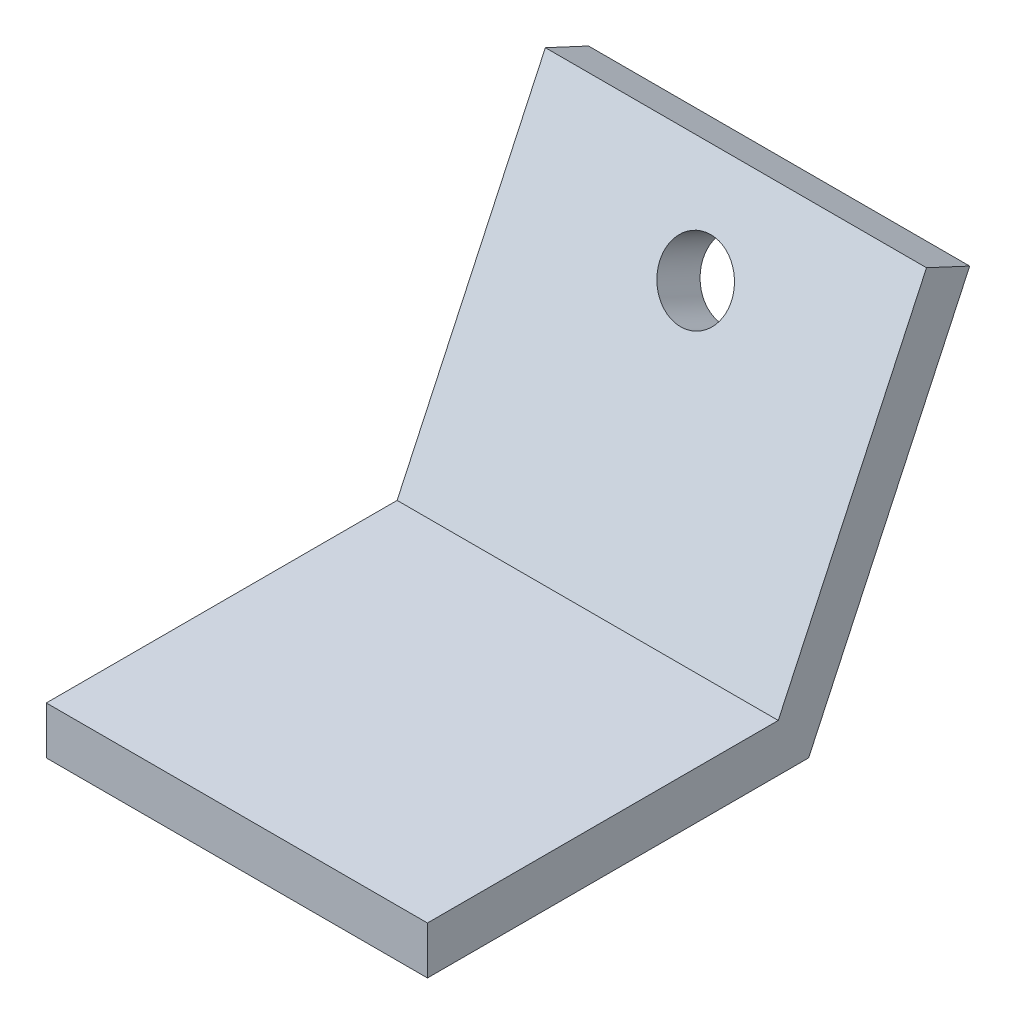
ISO-10303-21;
HEADER;
FILE_DESCRIPTION(('STEP AP214'),'2;1');
FILE_NAME('part.step','',(''),(''),'','','');
FILE_SCHEMA(('AUTOMOTIVE_DESIGN { 1 0 10303 214 1 1 1 1 }'));
ENDSEC;
DATA;
#1=APPLICATION_CONTEXT('core data for automotive mechanical design processes');
#2=APPLICATION_PROTOCOL_DEFINITION('international standard','automotive_design',2000,#1);
#3=PRODUCT_CONTEXT('',#1,'mechanical');
#4=PRODUCT('Part','Part','',(#3));
#5=PRODUCT_RELATED_PRODUCT_CATEGORY('part','',(#4));
#6=PRODUCT_DEFINITION_FORMATION('','',#4);
#7=PRODUCT_DEFINITION_CONTEXT('part definition',#1,'design');
#8=PRODUCT_DEFINITION('design','',#6,#7);
#9=PRODUCT_DEFINITION_SHAPE('','',#8);
#10=(LENGTH_UNIT() NAMED_UNIT(*) SI_UNIT(.MILLI.,.METRE.));
#11=(NAMED_UNIT(*) PLANE_ANGLE_UNIT() SI_UNIT($,.RADIAN.));
#12=(NAMED_UNIT(*) SI_UNIT($,.STERADIAN.) SOLID_ANGLE_UNIT());
#13=UNCERTAINTY_MEASURE_WITH_UNIT(LENGTH_MEASURE(1.E-05),#10,'distance_accuracy_value','');
#14=(GEOMETRIC_REPRESENTATION_CONTEXT(3) GLOBAL_UNCERTAINTY_ASSIGNED_CONTEXT((#13)) GLOBAL_UNIT_ASSIGNED_CONTEXT((#10,
#11,#12)) REPRESENTATION_CONTEXT('',''));
#15=CARTESIAN_POINT('',(0.,0.,0.));
#16=DIRECTION('',(0.,0.,1.));
#17=DIRECTION('',(1.,0.,0.));
#18=AXIS2_PLACEMENT_3D('',#15,#16,#17);
#19=CARTESIAN_POINT('',(50.8,6.35,-21.3546038438724));
#20=DIRECTION('',(0.,-1.,0.));
#21=DIRECTION('',(0.,0.,-1.));
#22=AXIS2_PLACEMENT_3D('',#19,#20,#21);
#23=PLANE('',#22);
#24=DIRECTION('',(0.,0.,1.));
#25=VECTOR('',#24,1.);
#26=CARTESIAN_POINT('',(0.,6.35,-21.3546038438724));
#27=LINE('',#26,#25);
#28=CARTESIAN_POINT('',(0.,6.35,-21.3546038438724));
#29=VERTEX_POINT('',#28);
#30=CARTESIAN_POINT('',(0.,6.35,25.4));
#31=VERTEX_POINT('',#30);
#32=EDGE_CURVE('E118',#29,#31,#27,.T.);
#33=ORIENTED_EDGE('',*,*,#32,.T.);
#34=DIRECTION('',(-1.,0.,0.));
#35=VECTOR('',#34,1.);
#36=CARTESIAN_POINT('',(50.8,6.35,25.4));
#37=LINE('',#36,#35);
#38=CARTESIAN_POINT('',(50.8,6.35,25.4));
#39=VERTEX_POINT('',#38);
#40=EDGE_CURVE('E41',#39,#31,#37,.T.);
#41=ORIENTED_EDGE('',*,*,#40,.F.);
#42=DIRECTION('',(0.,0.,1.));
#43=VECTOR('',#42,1.);
#44=CARTESIAN_POINT('',(50.8,6.35,-21.3546038438724));
#45=LINE('',#44,#43);
#46=CARTESIAN_POINT('',(50.8,6.35,-21.3546038438724));
#47=VERTEX_POINT('',#46);
#48=EDGE_CURVE('E129',#47,#39,#45,.T.);
#49=ORIENTED_EDGE('',*,*,#48,.F.);
#50=DIRECTION('',(-1.,0.,0.));
#51=VECTOR('',#50,1.);
#52=CARTESIAN_POINT('',(50.8,6.35,-21.3546038438724));
#53=LINE('',#52,#51);
#54=EDGE_CURVE('E114',#47,#29,#53,.T.);
#55=ORIENTED_EDGE('',*,*,#54,.T.);
#56=EDGE_LOOP('',(#33,#41,#49,#55));
#57=FACE_BOUND('',#56,.T.);
#58=ADVANCED_FACE('F33',(#57),#23,.F.);
#59=CARTESIAN_POINT('',(50.8,6.35,25.4));
#60=DIRECTION('',(0.,0.,-1.));
#61=DIRECTION('',(-1.,0.,0.));
#62=AXIS2_PLACEMENT_3D('',#59,#60,#61);
#63=PLANE('',#62);
#64=DIRECTION('',(0.,-1.,0.));
#65=VECTOR('',#64,1.);
#66=CARTESIAN_POINT('',(0.,6.35,25.4));
#67=LINE('',#66,#65);
#68=CARTESIAN_POINT('',(0.,0.,25.4));
#69=VERTEX_POINT('',#68);
#70=EDGE_CURVE('E121',#31,#69,#67,.T.);
#71=ORIENTED_EDGE('',*,*,#70,.T.);
#72=DIRECTION('',(-1.,0.,0.));
#73=VECTOR('',#72,1.);
#74=CARTESIAN_POINT('',(50.8,0.,25.4));
#75=LINE('',#74,#73);
#76=CARTESIAN_POINT('',(50.8,0.,25.4));
#77=VERTEX_POINT('',#76);
#78=EDGE_CURVE('E133',#77,#69,#75,.T.);
#79=ORIENTED_EDGE('',*,*,#78,.F.);
#80=DIRECTION('',(0.,-1.,0.));
#81=VECTOR('',#80,1.);
#82=CARTESIAN_POINT('',(50.8,6.35,25.4));
#83=LINE('',#82,#81);
#84=EDGE_CURVE('E87',#39,#77,#83,.T.);
#85=ORIENTED_EDGE('',*,*,#84,.F.);
#86=ORIENTED_EDGE('',*,*,#40,.T.);
#87=EDGE_LOOP('',(#71,#79,#85,#86));
#88=FACE_BOUND('',#87,.T.);
#89=ADVANCED_FACE('F136',(#88),#63,.F.);
#90=CARTESIAN_POINT('',(50.8,0.,25.4));
#91=DIRECTION('',(0.,1.,0.));
#92=DIRECTION('',(0.,0.,1.));
#93=AXIS2_PLACEMENT_3D('',#90,#91,#92);
#94=PLANE('',#93);
#95=CARTESIAN_POINT('',(25.4,0.,0.));
#96=DIRECTION('',(0.,1.,0.));
#97=DIRECTION('',(0.,0.,1.));
#98=AXIS2_PLACEMENT_3D('',#95,#96,#97);
#99=CIRCLE('',#98,4.7625);
#100=CARTESIAN_POINT('',(25.4,0.,4.7625));
#101=VERTEX_POINT('',#100);
#102=EDGE_CURVE('E11',#101,#101,#99,.F.);
#103=ORIENTED_EDGE('',*,*,#102,.F.);
#104=EDGE_LOOP('',(#103));
#105=FACE_BOUND('',#104,.T.);
#106=DIRECTION('',(0.,0.,-1.));
#107=VECTOR('',#106,1.);
#108=CARTESIAN_POINT('',(0.,0.,25.4));
#109=LINE('',#108,#107);
#110=CARTESIAN_POINT('',(0.,0.,-25.4));
#111=VERTEX_POINT('',#110);
#112=EDGE_CURVE('E124',#69,#111,#109,.T.);
#113=ORIENTED_EDGE('',*,*,#112,.T.);
#114=DIRECTION('',(-1.,0.,0.));
#115=VECTOR('',#114,1.);
#116=CARTESIAN_POINT('',(50.8,0.,-25.4));
#117=LINE('',#116,#115);
#118=CARTESIAN_POINT('',(50.8,0.,-25.4));
#119=VERTEX_POINT('',#118);
#120=EDGE_CURVE('E109',#119,#111,#117,.T.);
#121=ORIENTED_EDGE('',*,*,#120,.F.);
#122=DIRECTION('',(0.,0.,-1.));
#123=VECTOR('',#122,1.);
#124=CARTESIAN_POINT('',(50.8,0.,25.4));
#125=LINE('',#124,#123);
#126=EDGE_CURVE('E100',#77,#119,#125,.T.);
#127=ORIENTED_EDGE('',*,*,#126,.F.);
#128=ORIENTED_EDGE('',*,*,#78,.T.);
#129=EDGE_LOOP('',(#113,#121,#127,#128));
#130=FACE_BOUND('',#129,.T.);
#131=ADVANCED_FACE('F144',(#105,#130),#94,.F.);
#132=CARTESIAN_POINT('',(50.8,0.,-25.4));
#133=DIRECTION('',(0.,0.422618261740697,0.906307787036651));
#134=DIRECTION('',(0.,-0.906307787036651,0.422618261740697));
#135=AXIS2_PLACEMENT_3D('',#132,#133,#134);
#136=PLANE('',#135);
#137=CARTESIAN_POINT('',(25.4,34.5303266860964,-41.5017557723206));
#138=DIRECTION('',(0.,-0.422618261740697,-0.906307787036651));
#139=DIRECTION('',(0.,0.906307787036651,-0.422618261740697));
#140=AXIS2_PLACEMENT_3D('',#137,#138,#139);
#141=CIRCLE('',#140,4.7625);
#142=CARTESIAN_POINT('',(25.4,38.8466175218585,-43.5144752438606));
#143=VERTEX_POINT('',#142);
#144=EDGE_CURVE('E150',#143,#143,#141,.T.);
#145=ORIENTED_EDGE('',*,*,#144,.F.);
#146=EDGE_LOOP('',(#145));
#147=FACE_BOUND('',#146,.T.);
#148=DIRECTION('',(0.,0.906307787036651,-0.422618261740697));
#149=VECTOR('',#148,1.);
#150=CARTESIAN_POINT('',(0.,0.,-25.4));
#151=LINE('',#150,#149);
#152=CARTESIAN_POINT('',(0.,46.0404355814619,-46.8690076964274));
#153=VERTEX_POINT('',#152);
#154=EDGE_CURVE('E108',#111,#153,#151,.T.);
#155=ORIENTED_EDGE('',*,*,#154,.T.);
#156=DIRECTION('',(-1.,0.,0.));
#157=VECTOR('',#156,1.);
#158=CARTESIAN_POINT('',(50.8,46.0404355814619,-46.8690076964274));
#159=LINE('',#158,#157);
#160=CARTESIAN_POINT('',(50.8,46.0404355814619,-46.8690076964274));
#161=VERTEX_POINT('',#160);
#162=EDGE_CURVE('E105',#161,#153,#159,.T.);
#163=ORIENTED_EDGE('',*,*,#162,.F.);
#164=DIRECTION('',(0.,0.906307787036651,-0.422618261740697));
#165=VECTOR('',#164,1.);
#166=CARTESIAN_POINT('',(50.8,0.,-25.4));
#167=LINE('',#166,#165);
#168=EDGE_CURVE('E94',#119,#161,#167,.T.);
#169=ORIENTED_EDGE('',*,*,#168,.F.);
#170=ORIENTED_EDGE('',*,*,#120,.T.);
#171=EDGE_LOOP('',(#155,#163,#169,#170));
#172=FACE_BOUND('',#171,.T.);
#173=ADVANCED_FACE('F106',(#147,#172),#136,.F.);
#174=CARTESIAN_POINT('',(50.8,46.0404355814619,-46.8690076964274));
#175=DIRECTION('',(0.,-0.906307787036651,0.422618261740697));
#176=DIRECTION('',(0.,-0.422618261740697,-0.906307787036651));
#177=AXIS2_PLACEMENT_3D('',#174,#175,#176);
#178=PLANE('',#177);
#179=DIRECTION('',(0.,0.422618261740697,0.906307787036651));
#180=VECTOR('',#179,1.);
#181=CARTESIAN_POINT('',(0.,46.0404355814619,-46.8690076964274));
#182=LINE('',#181,#180);
#183=CARTESIAN_POINT('',(0.,48.7240615435153,-41.1139532487447));
#184=VERTEX_POINT('',#183);
#185=EDGE_CURVE('E72',#153,#184,#182,.T.);
#186=ORIENTED_EDGE('',*,*,#185,.T.);
#187=DIRECTION('',(-1.,0.,0.));
#188=VECTOR('',#187,1.);
#189=CARTESIAN_POINT('',(50.8,48.7240615435153,-41.1139532487447));
#190=LINE('',#189,#188);
#191=CARTESIAN_POINT('',(50.8,48.7240615435153,-41.1139532487447));
#192=VERTEX_POINT('',#191);
#193=EDGE_CURVE('E110',#192,#184,#190,.T.);
#194=ORIENTED_EDGE('',*,*,#193,.F.);
#195=DIRECTION('',(0.,0.422618261740697,0.906307787036651));
#196=VECTOR('',#195,1.);
#197=CARTESIAN_POINT('',(50.8,46.0404355814619,-46.8690076964274));
#198=LINE('',#197,#196);
#199=EDGE_CURVE('E98',#161,#192,#198,.T.);
#200=ORIENTED_EDGE('',*,*,#199,.F.);
#201=ORIENTED_EDGE('',*,*,#162,.T.);
#202=EDGE_LOOP('',(#186,#194,#200,#201));
#203=FACE_BOUND('',#202,.T.);
#204=ADVANCED_FACE('F112',(#203),#178,.F.);
#205=CARTESIAN_POINT('',(50.8,48.7240615435153,-41.1139532487447));
#206=DIRECTION('',(0.,-0.422618261740697,-0.906307787036651));
#207=DIRECTION('',(0.,0.906307787036651,-0.422618261740697));
#208=AXIS2_PLACEMENT_3D('',#205,#206,#207);
#209=PLANE('',#208);
#210=CARTESIAN_POINT('',(25.4,37.2139526481498,-35.7467013246378));
#211=DIRECTION('',(0.,-0.422618261740697,-0.906307787036651));
#212=DIRECTION('',(0.,0.906307787036651,-0.422618261740697));
#213=AXIS2_PLACEMENT_3D('',#210,#211,#212);
#214=CIRCLE('',#213,4.7625);
#215=CARTESIAN_POINT('',(25.4,41.5302434839119,-37.7594207961779));
#216=VERTEX_POINT('',#215);
#217=EDGE_CURVE('E122',#216,#216,#214,.F.);
#218=ORIENTED_EDGE('',*,*,#217,.F.);
#219=EDGE_LOOP('',(#218));
#220=FACE_BOUND('',#219,.T.);
#221=DIRECTION('',(0.,-0.906307787036651,0.422618261740697));
#222=VECTOR('',#221,1.);
#223=CARTESIAN_POINT('',(0.,48.7240615435153,-41.1139532487447));
#224=LINE('',#223,#222);
#225=EDGE_CURVE('E78',#184,#29,#224,.T.);
#226=ORIENTED_EDGE('',*,*,#225,.T.);
#227=ORIENTED_EDGE('',*,*,#54,.F.);
#228=DIRECTION('',(0.,-0.906307787036651,0.422618261740697));
#229=VECTOR('',#228,1.);
#230=CARTESIAN_POINT('',(50.8,48.7240615435153,-41.1139532487447));
#231=LINE('',#230,#229);
#232=EDGE_CURVE('E49',#192,#47,#231,.T.);
#233=ORIENTED_EDGE('',*,*,#232,.F.);
#234=ORIENTED_EDGE('',*,*,#193,.T.);
#235=EDGE_LOOP('',(#226,#227,#233,#234));
#236=FACE_BOUND('',#235,.T.);
#237=ADVANCED_FACE('F191',(#220,#236),#209,.F.);
#238=CARTESIAN_POINT('',(50.8,0.,0.));
#239=DIRECTION('',(1.,0.,0.));
#240=DIRECTION('',(0.,0.,-1.));
#241=AXIS2_PLACEMENT_3D('',#238,#239,#240);
#242=PLANE('',#241);
#243=ORIENTED_EDGE('',*,*,#48,.T.);
#244=ORIENTED_EDGE('',*,*,#84,.T.);
#245=ORIENTED_EDGE('',*,*,#126,.T.);
#246=ORIENTED_EDGE('',*,*,#168,.T.);
#247=ORIENTED_EDGE('',*,*,#199,.T.);
#248=ORIENTED_EDGE('',*,*,#232,.T.);
#249=EDGE_LOOP('',(#243,#244,#245,#246,#247,#248));
#250=FACE_BOUND('',#249,.T.);
#251=ADVANCED_FACE('F96',(#250),#242,.T.);
#252=CARTESIAN_POINT('',(0.,0.,0.));
#253=DIRECTION('',(1.,0.,0.));
#254=DIRECTION('',(0.,0.,-1.));
#255=AXIS2_PLACEMENT_3D('',#252,#253,#254);
#256=PLANE('',#255);
#257=ORIENTED_EDGE('',*,*,#32,.F.);
#258=ORIENTED_EDGE('',*,*,#225,.F.);
#259=ORIENTED_EDGE('',*,*,#185,.F.);
#260=ORIENTED_EDGE('',*,*,#154,.F.);
#261=ORIENTED_EDGE('',*,*,#112,.F.);
#262=ORIENTED_EDGE('',*,*,#70,.F.);
#263=EDGE_LOOP('',(#257,#258,#259,#260,#261,#262));
#264=FACE_BOUND('',#263,.T.);
#265=ADVANCED_FACE('F141',(#264),#256,.F.);
#266=CARTESIAN_POINT('',(25.4,62.6908364146046,18.8886522255425));
#267=DIRECTION('',(0.,-0.422618261740697,-0.906307787036651));
#268=DIRECTION('',(0.,0.906307787036651,-0.422618261740697));
#269=AXIS2_PLACEMENT_3D('',#266,#267,#268);
#270=CYLINDRICAL_SURFACE('',#269,4.7625);
#271=ORIENTED_EDGE('',*,*,#144,.T.);
#272=EDGE_LOOP('',(#271));
#273=FACE_BOUND('',#272,.T.);
#274=ORIENTED_EDGE('',*,*,#217,.T.);
#275=EDGE_LOOP('',(#274));
#276=FACE_BOUND('',#275,.T.);
#277=ADVANCED_FACE('F162',(#273,#276),#270,.F.);
#278=CARTESIAN_POINT('',(25.4,-12.7,0.));
#279=DIRECTION('',(0.,1.,0.));
#280=DIRECTION('',(0.,0.,1.));
#281=AXIS2_PLACEMENT_3D('',#278,#279,#280);
#282=CYLINDRICAL_SURFACE('',#281,4.7625);
#283=CARTESIAN_POINT('',(25.4,-12.7,0.));
#284=DIRECTION('',(0.,-1.,0.));
#285=DIRECTION('',(0.,0.,-1.));
#286=AXIS2_PLACEMENT_3D('',#283,#284,#285);
#287=CIRCLE('',#286,4.7625);
#288=CARTESIAN_POINT('',(25.4,-12.7,-4.7625));
#289=VERTEX_POINT('',#288);
#290=EDGE_CURVE('E153',#289,#289,#287,.T.);
#291=ORIENTED_EDGE('',*,*,#290,.F.);
#292=EDGE_LOOP('',(#291));
#293=FACE_BOUND('',#292,.T.);
#294=ORIENTED_EDGE('',*,*,#102,.T.);
#295=EDGE_LOOP('',(#294));
#296=FACE_BOUND('',#295,.T.);
#297=ADVANCED_FACE('F159',(#293,#296),#282,.T.);
#298=CARTESIAN_POINT('',(25.4,-12.7,0.));
#299=DIRECTION('',(0.,-1.,0.));
#300=DIRECTION('',(0.,0.,-1.));
#301=AXIS2_PLACEMENT_3D('',#298,#299,#300);
#302=PLANE('',#301);
#303=ORIENTED_EDGE('',*,*,#290,.T.);
#304=EDGE_LOOP('',(#303));
#305=FACE_BOUND('',#304,.T.);
#306=ADVANCED_FACE('F157',(#305),#302,.T.);
#307=CLOSED_SHELL('',(#58,#89,#131,#173,#204,#237,#251,#265,#277,#297,#306));
#308=MANIFOLD_SOLID_BREP('B2',#307);
#309=ADVANCED_BREP_SHAPE_REPRESENTATION('',(#18,#308),#14);
#310=SHAPE_DEFINITION_REPRESENTATION(#9,#309);
ENDSEC;
END-ISO-10303-21;
